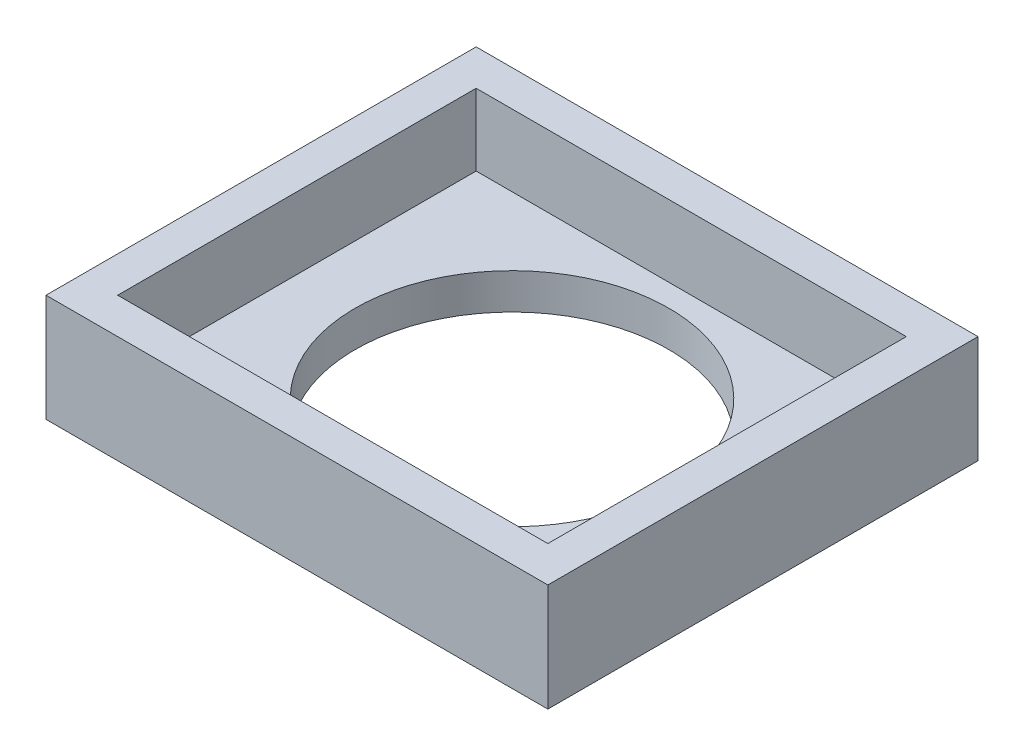
ISO-10303-21;
HEADER;
FILE_DESCRIPTION(('STEP AP214'),'2;1');
FILE_NAME('part.step','',(''),(''),'','','');
FILE_SCHEMA(('AUTOMOTIVE_DESIGN { 1 0 10303 214 1 1 1 1 }'));
ENDSEC;
DATA;
#1=APPLICATION_CONTEXT('core data for automotive mechanical design processes');
#2=APPLICATION_PROTOCOL_DEFINITION('international standard','automotive_design',2000,#1);
#3=PRODUCT_CONTEXT('',#1,'mechanical');
#4=PRODUCT('Part','Part','',(#3));
#5=PRODUCT_RELATED_PRODUCT_CATEGORY('part','',(#4));
#6=PRODUCT_DEFINITION_FORMATION('','',#4);
#7=PRODUCT_DEFINITION_CONTEXT('part definition',#1,'design');
#8=PRODUCT_DEFINITION('design','',#6,#7);
#9=PRODUCT_DEFINITION_SHAPE('','',#8);
#10=(LENGTH_UNIT() NAMED_UNIT(*) SI_UNIT(.MILLI.,.METRE.));
#11=(NAMED_UNIT(*) PLANE_ANGLE_UNIT() SI_UNIT($,.RADIAN.));
#12=(NAMED_UNIT(*) SI_UNIT($,.STERADIAN.) SOLID_ANGLE_UNIT());
#13=UNCERTAINTY_MEASURE_WITH_UNIT(LENGTH_MEASURE(1.E-05),#10,'distance_accuracy_value','');
#14=(GEOMETRIC_REPRESENTATION_CONTEXT(3) GLOBAL_UNCERTAINTY_ASSIGNED_CONTEXT((#13)) GLOBAL_UNIT_ASSIGNED_CONTEXT((#10,
#11,#12)) REPRESENTATION_CONTEXT('',''));
#15=CARTESIAN_POINT('',(0.,0.,0.));
#16=DIRECTION('',(0.,0.,1.));
#17=DIRECTION('',(1.,0.,0.));
#18=AXIS2_PLACEMENT_3D('',#15,#16,#17);
#19=CARTESIAN_POINT('',(0.,2.,0.));
#20=DIRECTION('',(0.,1.,0.));
#21=DIRECTION('',(0.,0.,1.));
#22=AXIS2_PLACEMENT_3D('',#19,#20,#21);
#23=PLANE('',#22);
#24=DIRECTION('',(1.,0.,0.));
#25=VECTOR('',#24,1.);
#26=CARTESIAN_POINT('',(-12.,2.,10.));
#27=LINE('',#26,#25);
#28=CARTESIAN_POINT('',(-12.,2.,10.));
#29=VERTEX_POINT('',#28);
#30=CARTESIAN_POINT('',(12.,2.,10.));
#31=VERTEX_POINT('',#30);
#32=EDGE_CURVE('E48',#29,#31,#27,.T.);
#33=ORIENTED_EDGE('',*,*,#32,.T.);
#34=DIRECTION('',(0.,0.,-1.));
#35=VECTOR('',#34,1.);
#36=CARTESIAN_POINT('',(12.,2.,10.));
#37=LINE('',#36,#35);
#38=CARTESIAN_POINT('',(12.,2.,-10.));
#39=VERTEX_POINT('',#38);
#40=EDGE_CURVE('E52',#31,#39,#37,.T.);
#41=ORIENTED_EDGE('',*,*,#40,.T.);
#42=DIRECTION('',(-1.,0.,0.));
#43=VECTOR('',#42,1.);
#44=CARTESIAN_POINT('',(12.,2.,-10.));
#45=LINE('',#44,#43);
#46=CARTESIAN_POINT('',(-12.,2.,-10.));
#47=VERTEX_POINT('',#46);
#48=EDGE_CURVE('E126',#39,#47,#45,.T.);
#49=ORIENTED_EDGE('',*,*,#48,.T.);
#50=DIRECTION('',(0.,0.,1.));
#51=VECTOR('',#50,1.);
#52=CARTESIAN_POINT('',(-12.,2.,-10.));
#53=LINE('',#52,#51);
#54=EDGE_CURVE('E107',#47,#29,#53,.T.);
#55=ORIENTED_EDGE('',*,*,#54,.T.);
#56=EDGE_LOOP('',(#33,#41,#49,#55));
#57=FACE_BOUND('',#56,.T.);
#58=CARTESIAN_POINT('',(0.,2.,0.));
#59=DIRECTION('',(0.,1.,0.));
#60=DIRECTION('',(0.,0.,1.));
#61=AXIS2_PLACEMENT_3D('',#58,#59,#60);
#62=CIRCLE('',#61,8.75);
#63=CARTESIAN_POINT('',(0.,2.,8.75));
#64=VERTEX_POINT('',#63);
#65=EDGE_CURVE('E146',#64,#64,#62,.T.);
#66=ORIENTED_EDGE('',*,*,#65,.F.);
#67=EDGE_LOOP('',(#66));
#68=FACE_BOUND('',#67,.T.);
#69=ADVANCED_FACE('F33',(#57,#68),#23,.T.);
#70=CARTESIAN_POINT('',(0.,0.,0.));
#71=DIRECTION('',(0.,1.,0.));
#72=DIRECTION('',(0.,0.,1.));
#73=AXIS2_PLACEMENT_3D('',#70,#71,#72);
#74=PLANE('',#73);
#75=DIRECTION('',(0.,0.,-1.));
#76=VECTOR('',#75,1.);
#77=CARTESIAN_POINT('',(14.,0.,-12.));
#78=LINE('',#77,#76);
#79=CARTESIAN_POINT('',(14.,0.,12.));
#80=VERTEX_POINT('',#79);
#81=CARTESIAN_POINT('',(14.,0.,-12.));
#82=VERTEX_POINT('',#81);
#83=EDGE_CURVE('E149',#80,#82,#78,.T.);
#84=ORIENTED_EDGE('',*,*,#83,.F.);
#85=DIRECTION('',(1.,0.,0.));
#86=VECTOR('',#85,1.);
#87=CARTESIAN_POINT('',(-14.,0.,12.));
#88=LINE('',#87,#86);
#89=CARTESIAN_POINT('',(-14.,0.,12.));
#90=VERTEX_POINT('',#89);
#91=EDGE_CURVE('E158',#90,#80,#88,.T.);
#92=ORIENTED_EDGE('',*,*,#91,.F.);
#93=DIRECTION('',(0.,0.,1.));
#94=VECTOR('',#93,1.);
#95=CARTESIAN_POINT('',(-14.,0.,-12.));
#96=LINE('',#95,#94);
#97=CARTESIAN_POINT('',(-14.,0.,-12.));
#98=VERTEX_POINT('',#97);
#99=EDGE_CURVE('E156',#98,#90,#96,.T.);
#100=ORIENTED_EDGE('',*,*,#99,.F.);
#101=DIRECTION('',(-1.,0.,0.));
#102=VECTOR('',#101,1.);
#103=CARTESIAN_POINT('',(-14.,0.,-12.));
#104=LINE('',#103,#102);
#105=EDGE_CURVE('E154',#82,#98,#104,.T.);
#106=ORIENTED_EDGE('',*,*,#105,.F.);
#107=EDGE_LOOP('',(#84,#92,#100,#106));
#108=FACE_BOUND('',#107,.T.);
#109=CARTESIAN_POINT('',(0.,0.,0.));
#110=DIRECTION('',(0.,1.,0.));
#111=DIRECTION('',(0.,0.,1.));
#112=AXIS2_PLACEMENT_3D('',#109,#110,#111);
#113=CIRCLE('',#112,8.75);
#114=CARTESIAN_POINT('',(0.,0.,8.75));
#115=VERTEX_POINT('',#114);
#116=EDGE_CURVE('E145',#115,#115,#113,.T.);
#117=ORIENTED_EDGE('',*,*,#116,.T.);
#118=EDGE_LOOP('',(#117));
#119=FACE_BOUND('',#118,.T.);
#120=ADVANCED_FACE('F175',(#108,#119),#74,.F.);
#121=CARTESIAN_POINT('',(14.,2.,-12.));
#122=DIRECTION('',(-1.,0.,0.));
#123=DIRECTION('',(0.,0.,1.));
#124=AXIS2_PLACEMENT_3D('',#121,#122,#123);
#125=PLANE('',#124);
#126=ORIENTED_EDGE('',*,*,#83,.T.);
#127=DIRECTION('',(0.,-1.,0.));
#128=VECTOR('',#127,1.);
#129=CARTESIAN_POINT('',(14.,2.,-12.));
#130=LINE('',#129,#128);
#131=CARTESIAN_POINT('',(14.,6.,-12.));
#132=VERTEX_POINT('',#131);
#133=EDGE_CURVE('E11',#132,#82,#130,.T.);
#134=ORIENTED_EDGE('',*,*,#133,.F.);
#135=DIRECTION('',(0.,0.,-1.));
#136=VECTOR('',#135,1.);
#137=CARTESIAN_POINT('',(14.,6.,12.));
#138=LINE('',#137,#136);
#139=CARTESIAN_POINT('',(14.,6.,12.));
#140=VERTEX_POINT('',#139);
#141=EDGE_CURVE('E136',#140,#132,#138,.T.);
#142=ORIENTED_EDGE('',*,*,#141,.F.);
#143=DIRECTION('',(0.,-1.,0.));
#144=VECTOR('',#143,1.);
#145=CARTESIAN_POINT('',(14.,2.,12.));
#146=LINE('',#145,#144);
#147=EDGE_CURVE('E160',#140,#80,#146,.T.);
#148=ORIENTED_EDGE('',*,*,#147,.T.);
#149=EDGE_LOOP('',(#126,#134,#142,#148));
#150=FACE_BOUND('',#149,.T.);
#151=ADVANCED_FACE('F35',(#150),#125,.F.);
#152=CARTESIAN_POINT('',(-14.,2.,-12.));
#153=DIRECTION('',(0.,0.,1.));
#154=DIRECTION('',(1.,0.,0.));
#155=AXIS2_PLACEMENT_3D('',#152,#153,#154);
#156=PLANE('',#155);
#157=ORIENTED_EDGE('',*,*,#105,.T.);
#158=DIRECTION('',(0.,-1.,0.));
#159=VECTOR('',#158,1.);
#160=CARTESIAN_POINT('',(-14.,2.,-12.));
#161=LINE('',#160,#159);
#162=CARTESIAN_POINT('',(-14.,6.,-12.));
#163=VERTEX_POINT('',#162);
#164=EDGE_CURVE('E41',#163,#98,#161,.T.);
#165=ORIENTED_EDGE('',*,*,#164,.F.);
#166=DIRECTION('',(-1.,0.,0.));
#167=VECTOR('',#166,1.);
#168=CARTESIAN_POINT('',(14.,6.,-12.));
#169=LINE('',#168,#167);
#170=EDGE_CURVE('E139',#132,#163,#169,.T.);
#171=ORIENTED_EDGE('',*,*,#170,.F.);
#172=ORIENTED_EDGE('',*,*,#133,.T.);
#173=EDGE_LOOP('',(#157,#165,#171,#172));
#174=FACE_BOUND('',#173,.T.);
#175=ADVANCED_FACE('F183',(#174),#156,.F.);
#176=CARTESIAN_POINT('',(-14.,2.,-12.));
#177=DIRECTION('',(1.,0.,0.));
#178=DIRECTION('',(0.,0.,-1.));
#179=AXIS2_PLACEMENT_3D('',#176,#177,#178);
#180=PLANE('',#179);
#181=ORIENTED_EDGE('',*,*,#99,.T.);
#182=DIRECTION('',(0.,-1.,0.));
#183=VECTOR('',#182,1.);
#184=CARTESIAN_POINT('',(-14.,2.,12.));
#185=LINE('',#184,#183);
#186=CARTESIAN_POINT('',(-14.,6.,12.));
#187=VERTEX_POINT('',#186);
#188=EDGE_CURVE('E163',#187,#90,#185,.T.);
#189=ORIENTED_EDGE('',*,*,#188,.F.);
#190=DIRECTION('',(0.,0.,1.));
#191=VECTOR('',#190,1.);
#192=CARTESIAN_POINT('',(-14.,6.,-12.));
#193=LINE('',#192,#191);
#194=EDGE_CURVE('E142',#163,#187,#193,.T.);
#195=ORIENTED_EDGE('',*,*,#194,.F.);
#196=ORIENTED_EDGE('',*,*,#164,.T.);
#197=EDGE_LOOP('',(#181,#189,#195,#196));
#198=FACE_BOUND('',#197,.T.);
#199=ADVANCED_FACE('F169',(#198),#180,.F.);
#200=CARTESIAN_POINT('',(-14.,2.,12.));
#201=DIRECTION('',(0.,0.,-1.));
#202=DIRECTION('',(-1.,0.,0.));
#203=AXIS2_PLACEMENT_3D('',#200,#201,#202);
#204=PLANE('',#203);
#205=ORIENTED_EDGE('',*,*,#91,.T.);
#206=ORIENTED_EDGE('',*,*,#147,.F.);
#207=DIRECTION('',(1.,0.,0.));
#208=VECTOR('',#207,1.);
#209=CARTESIAN_POINT('',(-14.,6.,12.));
#210=LINE('',#209,#208);
#211=EDGE_CURVE('E112',#187,#140,#210,.T.);
#212=ORIENTED_EDGE('',*,*,#211,.F.);
#213=ORIENTED_EDGE('',*,*,#188,.T.);
#214=EDGE_LOOP('',(#205,#206,#212,#213));
#215=FACE_BOUND('',#214,.T.);
#216=ADVANCED_FACE('F178',(#215),#204,.F.);
#217=CARTESIAN_POINT('',(0.,2.,0.));
#218=DIRECTION('',(0.,-1.,0.));
#219=DIRECTION('',(0.,0.,-1.));
#220=AXIS2_PLACEMENT_3D('',#217,#218,#219);
#221=CYLINDRICAL_SURFACE('',#220,8.75);
#222=ORIENTED_EDGE('',*,*,#65,.T.);
#223=EDGE_LOOP('',(#222));
#224=FACE_BOUND('',#223,.T.);
#225=ORIENTED_EDGE('',*,*,#116,.F.);
#226=EDGE_LOOP('',(#225));
#227=FACE_BOUND('',#226,.T.);
#228=ADVANCED_FACE('F198',(#224,#227),#221,.F.);
#229=CARTESIAN_POINT('',(0.,6.,0.));
#230=DIRECTION('',(0.,1.,0.));
#231=DIRECTION('',(0.,0.,1.));
#232=AXIS2_PLACEMENT_3D('',#229,#230,#231);
#233=PLANE('',#232);
#234=ORIENTED_EDGE('',*,*,#211,.T.);
#235=ORIENTED_EDGE('',*,*,#141,.T.);
#236=ORIENTED_EDGE('',*,*,#170,.T.);
#237=ORIENTED_EDGE('',*,*,#194,.T.);
#238=EDGE_LOOP('',(#234,#235,#236,#237));
#239=FACE_BOUND('',#238,.T.);
#240=DIRECTION('',(0.,0.,-1.));
#241=VECTOR('',#240,1.);
#242=CARTESIAN_POINT('',(12.,6.,10.));
#243=LINE('',#242,#241);
#244=CARTESIAN_POINT('',(12.,6.,10.));
#245=VERTEX_POINT('',#244);
#246=CARTESIAN_POINT('',(12.,6.,-10.));
#247=VERTEX_POINT('',#246);
#248=EDGE_CURVE('E106',#245,#247,#243,.T.);
#249=ORIENTED_EDGE('',*,*,#248,.F.);
#250=DIRECTION('',(1.,0.,0.));
#251=VECTOR('',#250,1.);
#252=CARTESIAN_POINT('',(-12.,6.,10.));
#253=LINE('',#252,#251);
#254=CARTESIAN_POINT('',(-12.,6.,10.));
#255=VERTEX_POINT('',#254);
#256=EDGE_CURVE('E97',#255,#245,#253,.T.);
#257=ORIENTED_EDGE('',*,*,#256,.F.);
#258=DIRECTION('',(0.,0.,1.));
#259=VECTOR('',#258,1.);
#260=CARTESIAN_POINT('',(-12.,6.,-10.));
#261=LINE('',#260,#259);
#262=CARTESIAN_POINT('',(-12.,6.,-10.));
#263=VERTEX_POINT('',#262);
#264=EDGE_CURVE('E120',#263,#255,#261,.T.);
#265=ORIENTED_EDGE('',*,*,#264,.F.);
#266=DIRECTION('',(-1.,0.,0.));
#267=VECTOR('',#266,1.);
#268=CARTESIAN_POINT('',(12.,6.,-10.));
#269=LINE('',#268,#267);
#270=EDGE_CURVE('E118',#247,#263,#269,.T.);
#271=ORIENTED_EDGE('',*,*,#270,.F.);
#272=EDGE_LOOP('',(#249,#257,#265,#271));
#273=FACE_BOUND('',#272,.T.);
#274=ADVANCED_FACE('F116',(#239,#273),#233,.T.);
#275=CARTESIAN_POINT('',(-12.,6.,10.));
#276=DIRECTION('',(0.,0.,-1.));
#277=DIRECTION('',(-1.,0.,0.));
#278=AXIS2_PLACEMENT_3D('',#275,#276,#277);
#279=PLANE('',#278);
#280=ORIENTED_EDGE('',*,*,#32,.F.);
#281=DIRECTION('',(0.,-1.,0.));
#282=VECTOR('',#281,1.);
#283=CARTESIAN_POINT('',(-12.,6.,10.));
#284=LINE('',#283,#282);
#285=EDGE_CURVE('E102',#255,#29,#284,.T.);
#286=ORIENTED_EDGE('',*,*,#285,.F.);
#287=ORIENTED_EDGE('',*,*,#256,.T.);
#288=DIRECTION('',(0.,-1.,0.));
#289=VECTOR('',#288,1.);
#290=CARTESIAN_POINT('',(12.,6.,10.));
#291=LINE('',#290,#289);
#292=EDGE_CURVE('E100',#245,#31,#291,.T.);
#293=ORIENTED_EDGE('',*,*,#292,.T.);
#294=EDGE_LOOP('',(#280,#286,#287,#293));
#295=FACE_BOUND('',#294,.T.);
#296=ADVANCED_FACE('F99',(#295),#279,.T.);
#297=CARTESIAN_POINT('',(12.,6.,10.));
#298=DIRECTION('',(-1.,0.,0.));
#299=DIRECTION('',(0.,0.,1.));
#300=AXIS2_PLACEMENT_3D('',#297,#298,#299);
#301=PLANE('',#300);
#302=ORIENTED_EDGE('',*,*,#40,.F.);
#303=ORIENTED_EDGE('',*,*,#292,.F.);
#304=ORIENTED_EDGE('',*,*,#248,.T.);
#305=DIRECTION('',(0.,-1.,0.));
#306=VECTOR('',#305,1.);
#307=CARTESIAN_POINT('',(12.,6.,-10.));
#308=LINE('',#307,#306);
#309=EDGE_CURVE('E113',#247,#39,#308,.T.);
#310=ORIENTED_EDGE('',*,*,#309,.T.);
#311=EDGE_LOOP('',(#302,#303,#304,#310));
#312=FACE_BOUND('',#311,.T.);
#313=ADVANCED_FACE('F110',(#312),#301,.T.);
#314=CARTESIAN_POINT('',(12.,6.,-10.));
#315=DIRECTION('',(0.,0.,1.));
#316=DIRECTION('',(1.,0.,0.));
#317=AXIS2_PLACEMENT_3D('',#314,#315,#316);
#318=PLANE('',#317);
#319=ORIENTED_EDGE('',*,*,#48,.F.);
#320=ORIENTED_EDGE('',*,*,#309,.F.);
#321=ORIENTED_EDGE('',*,*,#270,.T.);
#322=DIRECTION('',(0.,-1.,0.));
#323=VECTOR('',#322,1.);
#324=CARTESIAN_POINT('',(-12.,6.,-10.));
#325=LINE('',#324,#323);
#326=EDGE_CURVE('E130',#263,#47,#325,.T.);
#327=ORIENTED_EDGE('',*,*,#326,.T.);
#328=EDGE_LOOP('',(#319,#320,#321,#327));
#329=FACE_BOUND('',#328,.T.);
#330=ADVANCED_FACE('F219',(#329),#318,.T.);
#331=CARTESIAN_POINT('',(-12.,6.,-10.));
#332=DIRECTION('',(1.,0.,0.));
#333=DIRECTION('',(0.,0.,-1.));
#334=AXIS2_PLACEMENT_3D('',#331,#332,#333);
#335=PLANE('',#334);
#336=ORIENTED_EDGE('',*,*,#54,.F.);
#337=ORIENTED_EDGE('',*,*,#326,.F.);
#338=ORIENTED_EDGE('',*,*,#264,.T.);
#339=ORIENTED_EDGE('',*,*,#285,.T.);
#340=EDGE_LOOP('',(#336,#337,#338,#339));
#341=FACE_BOUND('',#340,.T.);
#342=ADVANCED_FACE('F222',(#341),#335,.T.);
#343=CLOSED_SHELL('',(#69,#120,#151,#175,#199,#216,#228,#274,#296,#313,#330,#342));
#344=MANIFOLD_SOLID_BREP('B2',#343);
#345=ADVANCED_BREP_SHAPE_REPRESENTATION('',(#18,#344),#14);
#346=SHAPE_DEFINITION_REPRESENTATION(#9,#345);
ENDSEC;
END-ISO-10303-21;
